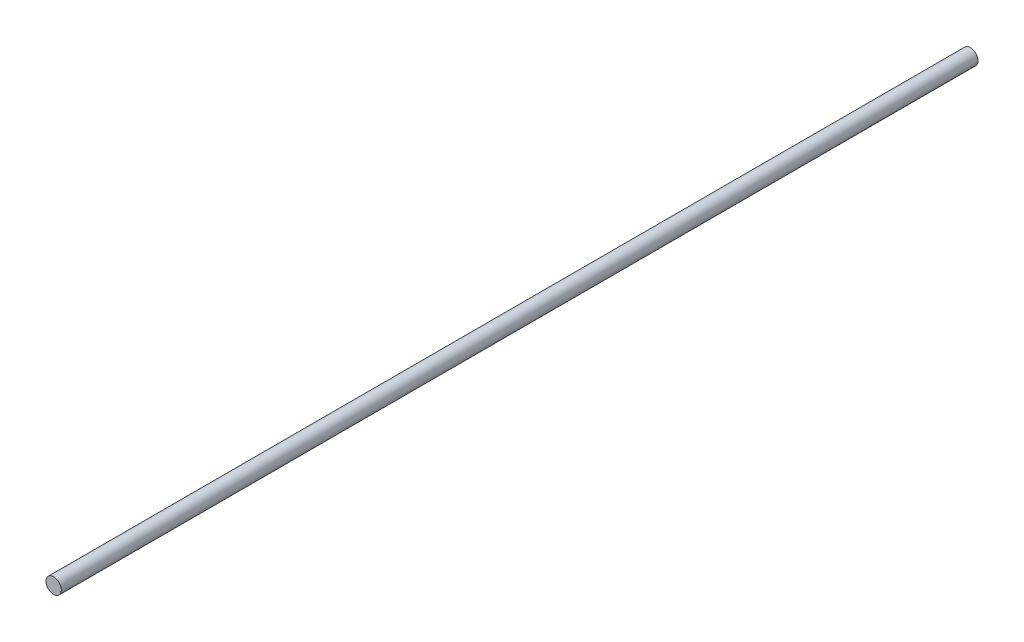
ISO-10303-21;
HEADER;
FILE_DESCRIPTION(('STEP AP214'),'2;1');
FILE_NAME('part.step','',(''),(''),'','','');
FILE_SCHEMA(('AUTOMOTIVE_DESIGN { 1 0 10303 214 1 1 1 1 }'));
ENDSEC;
DATA;
#1=APPLICATION_CONTEXT('core data for automotive mechanical design processes');
#2=APPLICATION_PROTOCOL_DEFINITION('international standard','automotive_design',2000,#1);
#3=PRODUCT_CONTEXT('',#1,'mechanical');
#4=PRODUCT('Part','Part','',(#3));
#5=PRODUCT_RELATED_PRODUCT_CATEGORY('part','',(#4));
#6=PRODUCT_DEFINITION_FORMATION('','',#4);
#7=PRODUCT_DEFINITION_CONTEXT('part definition',#1,'design');
#8=PRODUCT_DEFINITION('design','',#6,#7);
#9=PRODUCT_DEFINITION_SHAPE('','',#8);
#10=(LENGTH_UNIT() NAMED_UNIT(*) SI_UNIT(.MILLI.,.METRE.));
#11=(NAMED_UNIT(*) PLANE_ANGLE_UNIT() SI_UNIT($,.RADIAN.));
#12=(NAMED_UNIT(*) SI_UNIT($,.STERADIAN.) SOLID_ANGLE_UNIT());
#13=UNCERTAINTY_MEASURE_WITH_UNIT(LENGTH_MEASURE(1.E-05),#10,'distance_accuracy_value','');
#14=(GEOMETRIC_REPRESENTATION_CONTEXT(3) GLOBAL_UNCERTAINTY_ASSIGNED_CONTEXT((#13)) GLOBAL_UNIT_ASSIGNED_CONTEXT((#10,
#11,#12)) REPRESENTATION_CONTEXT('',''));
#15=CARTESIAN_POINT('',(0.,0.,0.));
#16=DIRECTION('',(0.,0.,1.));
#17=DIRECTION('',(1.,0.,0.));
#18=AXIS2_PLACEMENT_3D('',#15,#16,#17);
#19=CARTESIAN_POINT('',(0.,0.,298.65));
#20=DIRECTION('',(0.,0.,-1.));
#21=DIRECTION('',(-1.,0.,0.));
#22=AXIS2_PLACEMENT_3D('',#19,#20,#21);
#23=CYLINDRICAL_SURFACE('',#22,2.5);
#24=CARTESIAN_POINT('',(0.,0.,298.65));
#25=DIRECTION('',(0.,0.,1.));
#26=DIRECTION('',(1.,0.,0.));
#27=AXIS2_PLACEMENT_3D('',#24,#25,#26);
#28=CIRCLE('',#27,2.5);
#29=CARTESIAN_POINT('',(2.5,0.,298.65));
#30=VERTEX_POINT('',#29);
#31=EDGE_CURVE('E10',#30,#30,#28,.T.);
#32=ORIENTED_EDGE('',*,*,#31,.F.);
#33=EDGE_LOOP('',(#32));
#34=FACE_BOUND('',#33,.T.);
#35=CARTESIAN_POINT('',(0.,0.,0.));
#36=DIRECTION('',(0.,0.,1.));
#37=DIRECTION('',(1.,0.,0.));
#38=AXIS2_PLACEMENT_3D('',#35,#36,#37);
#39=CIRCLE('',#38,2.5);
#40=CARTESIAN_POINT('',(2.5,0.,0.));
#41=VERTEX_POINT('',#40);
#42=EDGE_CURVE('E36',#41,#41,#39,.T.);
#43=ORIENTED_EDGE('',*,*,#42,.T.);
#44=EDGE_LOOP('',(#43));
#45=FACE_BOUND('',#44,.T.);
#46=ADVANCED_FACE('F33',(#34,#45),#23,.T.);
#47=CARTESIAN_POINT('',(0.,0.,298.65));
#48=DIRECTION('',(0.,0.,1.));
#49=DIRECTION('',(1.,0.,0.));
#50=AXIS2_PLACEMENT_3D('',#47,#48,#49);
#51=PLANE('',#50);
#52=ORIENTED_EDGE('',*,*,#31,.T.);
#53=EDGE_LOOP('',(#52));
#54=FACE_BOUND('',#53,.T.);
#55=ADVANCED_FACE('F48',(#54),#51,.T.);
#56=CARTESIAN_POINT('',(0.,0.,0.));
#57=DIRECTION('',(0.,0.,1.));
#58=DIRECTION('',(1.,0.,0.));
#59=AXIS2_PLACEMENT_3D('',#56,#57,#58);
#60=PLANE('',#59);
#61=ORIENTED_EDGE('',*,*,#42,.F.);
#62=EDGE_LOOP('',(#61));
#63=FACE_BOUND('',#62,.T.);
#64=ADVANCED_FACE('F46',(#63),#60,.F.);
#65=CLOSED_SHELL('',(#46,#55,#64));
#66=MANIFOLD_SOLID_BREP('B2',#65);
#67=ADVANCED_BREP_SHAPE_REPRESENTATION('',(#18,#66),#14);
#68=SHAPE_DEFINITION_REPRESENTATION(#9,#67);
ENDSEC;
END-ISO-10303-21;
